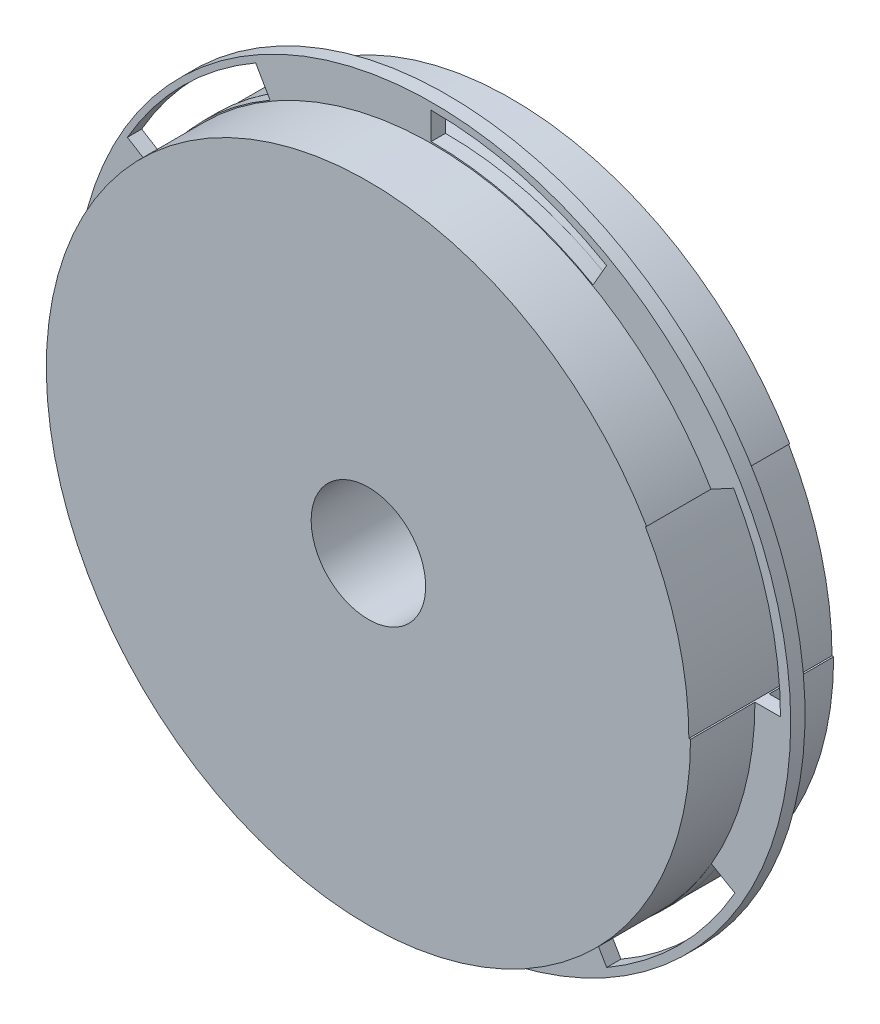
ISO-10303-21;
HEADER;
FILE_DESCRIPTION(('STEP AP214'),'2;1');
FILE_NAME('part.step','',(''),(''),'','','');
FILE_SCHEMA(('AUTOMOTIVE_DESIGN { 1 0 10303 214 1 1 1 1 }'));
ENDSEC;
DATA;
#1=APPLICATION_CONTEXT('core data for automotive mechanical design processes');
#2=APPLICATION_PROTOCOL_DEFINITION('international standard','automotive_design',2000,#1);
#3=PRODUCT_CONTEXT('',#1,'mechanical');
#4=PRODUCT('Part','Part','',(#3));
#5=PRODUCT_RELATED_PRODUCT_CATEGORY('part','',(#4));
#6=PRODUCT_DEFINITION_FORMATION('','',#4);
#7=PRODUCT_DEFINITION_CONTEXT('part definition',#1,'design');
#8=PRODUCT_DEFINITION('design','',#6,#7);
#9=PRODUCT_DEFINITION_SHAPE('','',#8);
#10=(LENGTH_UNIT() NAMED_UNIT(*) SI_UNIT(.MILLI.,.METRE.));
#11=(NAMED_UNIT(*) PLANE_ANGLE_UNIT() SI_UNIT($,.RADIAN.));
#12=(NAMED_UNIT(*) SI_UNIT($,.STERADIAN.) SOLID_ANGLE_UNIT());
#13=UNCERTAINTY_MEASURE_WITH_UNIT(LENGTH_MEASURE(1.E-05),#10,'distance_accuracy_value','');
#14=(GEOMETRIC_REPRESENTATION_CONTEXT(3) GLOBAL_UNCERTAINTY_ASSIGNED_CONTEXT((#13)) GLOBAL_UNIT_ASSIGNED_CONTEXT((#10,
#11,#12)) REPRESENTATION_CONTEXT('',''));
#15=CARTESIAN_POINT('',(0.,0.,0.));
#16=DIRECTION('',(0.,0.,1.));
#17=DIRECTION('',(1.,0.,0.));
#18=AXIS2_PLACEMENT_3D('',#15,#16,#17);
#19=CARTESIAN_POINT('',(-23.5895127727693,15.6012459474451,10.));
#20=DIRECTION('',(0.,0.,-1.));
#21=DIRECTION('',(-1.,0.,0.));
#22=AXIS2_PLACEMENT_3D('',#19,#20,#21);
#23=CYLINDRICAL_SURFACE('',#22,25.);
#24=CARTESIAN_POINT('',(-23.5895127727693,15.6012459474451,5.5));
#25=DIRECTION('',(0.,0.,1.));
#26=DIRECTION('',(1.,0.,0.));
#27=AXIS2_PLACEMENT_3D('',#24,#25,#26);
#28=CIRCLE('',#27,25.);
#29=CARTESIAN_POINT('',(1.41048722723074,15.6012459474451,5.5));
#30=VERTEX_POINT('',#29);
#31=EDGE_CURVE('E305',#30,#30,#28,.T.);
#32=ORIENTED_EDGE('',*,*,#31,.F.);
#33=EDGE_LOOP('',(#32));
#34=FACE_BOUND('',#33,.T.);
#35=CARTESIAN_POINT('',(-23.5895127727693,15.6012459474451,4.5));
#36=DIRECTION('',(0.,0.,-1.));
#37=DIRECTION('',(-1.,0.,0.));
#38=AXIS2_PLACEMENT_3D('',#35,#36,#37);
#39=CIRCLE('',#38,25.);
#40=CARTESIAN_POINT('',(-48.5895127727693,15.6012459474451,4.5));
#41=VERTEX_POINT('',#40);
#42=EDGE_CURVE('E249',#41,#41,#39,.T.);
#43=ORIENTED_EDGE('',*,*,#42,.F.);
#44=EDGE_LOOP('',(#43));
#45=FACE_BOUND('',#44,.T.);
#46=ADVANCED_FACE('F39',(#34,#45),#23,.T.);
#47=CARTESIAN_POINT('',(-23.647365997325,15.7014506717574,0.));
#48=DIRECTION('',(0.,0.,1.));
#49=DIRECTION('',(1.,0.,0.));
#50=AXIS2_PLACEMENT_3D('',#47,#48,#49);
#51=CYLINDRICAL_SURFACE('',#50,22.5);
#52=DIRECTION('',(0.,0.,1.));
#53=VECTOR('',#52,1.);
#54=CARTESIAN_POINT('',(-12.3973659973248,35.1870222569071,0.));
#55=LINE('',#54,#53);
#56=CARTESIAN_POINT('',(-12.3973659973248,35.1870222569071,4.5));
#57=VERTEX_POINT('',#56);
#58=CARTESIAN_POINT('',(-12.3973659973248,35.1870222569071,5.5));
#59=VERTEX_POINT('',#58);
#60=EDGE_CURVE('E395',#57,#59,#55,.T.);
#61=ORIENTED_EDGE('',*,*,#60,.F.);
#62=CARTESIAN_POINT('',(-23.647365997325,15.7014506717574,4.5));
#63=DIRECTION('',(0.,0.,-1.));
#64=DIRECTION('',(-1.,0.,0.));
#65=AXIS2_PLACEMENT_3D('',#62,#63,#64);
#66=CIRCLE('',#65,22.5);
#67=CARTESIAN_POINT('',(-23.7052192218805,38.2013762939547,4.5));
#68=VERTEX_POINT('',#67);
#69=EDGE_CURVE('E53',#57,#68,#66,.F.);
#70=ORIENTED_EDGE('',*,*,#69,.T.);
#71=DIRECTION('',(0.,0.,1.));
#72=VECTOR('',#71,1.);
#73=CARTESIAN_POINT('',(-23.7052192218805,38.2013762939547,0.));
#74=LINE('',#73,#72);
#75=CARTESIAN_POINT('',(-23.7052192218805,38.2013762939547,5.5));
#76=VERTEX_POINT('',#75);
#77=EDGE_CURVE('E440',#68,#76,#74,.T.);
#78=ORIENTED_EDGE('',*,*,#77,.T.);
#79=CARTESIAN_POINT('',(-23.647365997325,15.7014506717574,5.5));
#80=DIRECTION('',(0.,0.,1.));
#81=DIRECTION('',(1.,0.,0.));
#82=AXIS2_PLACEMENT_3D('',#79,#80,#81);
#83=CIRCLE('',#82,22.5);
#84=EDGE_CURVE('E372',#76,#59,#83,.F.);
#85=ORIENTED_EDGE('',*,*,#84,.T.);
#86=EDGE_LOOP('',(#61,#70,#78,#85));
#87=FACE_BOUND('',#86,.T.);
#88=ADVANCED_FACE('F497',(#87),#51,.T.);
#89=CARTESIAN_POINT('',(-23.7052192218809,2.59717104861497E-13,0.));
#90=DIRECTION('',(1.,0.,0.));
#91=DIRECTION('',(0.,1.,0.));
#92=AXIS2_PLACEMENT_3D('',#89,#90,#91);
#93=PLANE('',#92);
#94=ORIENTED_EDGE('',*,*,#77,.F.);
#95=DIRECTION('',(0.,1.,0.));
#96=VECTOR('',#95,1.);
#97=CARTESIAN_POINT('',(-23.7052192218809,2.59717104861497E-13,4.5));
#98=LINE('',#97,#96);
#99=CARTESIAN_POINT('',(-23.7052192218805,40.1013820856858,4.5));
#100=VERTEX_POINT('',#99);
#101=EDGE_CURVE('E297',#68,#100,#98,.T.);
#102=ORIENTED_EDGE('',*,*,#101,.T.);
#103=DIRECTION('',(0.,0.,1.));
#104=VECTOR('',#103,1.);
#105=CARTESIAN_POINT('',(-23.7052192218805,40.1013820856858,0.));
#106=LINE('',#105,#104);
#107=CARTESIAN_POINT('',(-23.7052192218805,40.1013820856858,5.5));
#108=VERTEX_POINT('',#107);
#109=EDGE_CURVE('E443',#100,#108,#106,.T.);
#110=ORIENTED_EDGE('',*,*,#109,.T.);
#111=DIRECTION('',(0.,-1.,0.));
#112=VECTOR('',#111,1.);
#113=CARTESIAN_POINT('',(-23.7052192218809,2.59717104861497E-13,5.5));
#114=LINE('',#113,#112);
#115=EDGE_CURVE('E369',#108,#76,#114,.T.);
#116=ORIENTED_EDGE('',*,*,#115,.T.);
#117=EDGE_LOOP('',(#94,#102,#110,#116));
#118=FACE_BOUND('',#117,.T.);
#119=ADVANCED_FACE('F502',(#118),#93,.T.);
#120=CARTESIAN_POINT('',(-23.647365997325,15.7014506717574,0.));
#121=DIRECTION('',(0.,0.,1.));
#122=DIRECTION('',(1.,0.,0.));
#123=AXIS2_PLACEMENT_3D('',#120,#121,#122);
#124=CYLINDRICAL_SURFACE('',#123,24.4);
#125=CARTESIAN_POINT('',(-23.647365997325,15.7014506717574,4.5));
#126=DIRECTION('',(0.,0.,-1.));
#127=DIRECTION('',(-1.,0.,0.));
#128=AXIS2_PLACEMENT_3D('',#125,#126,#127);
#129=CIRCLE('',#128,24.4);
#130=CARTESIAN_POINT('',(-11.4473659973248,36.8324705240976,4.5));
#131=VERTEX_POINT('',#130);
#132=EDGE_CURVE('E295',#131,#100,#129,.F.);
#133=ORIENTED_EDGE('',*,*,#132,.F.);
#134=DIRECTION('',(0.,0.,1.));
#135=VECTOR('',#134,1.);
#136=CARTESIAN_POINT('',(-11.4473659973248,36.8324705240976,0.));
#137=LINE('',#136,#135);
#138=CARTESIAN_POINT('',(-11.4473659973248,36.8324705240976,5.5));
#139=VERTEX_POINT('',#138);
#140=EDGE_CURVE('E445',#131,#139,#137,.T.);
#141=ORIENTED_EDGE('',*,*,#140,.T.);
#142=CARTESIAN_POINT('',(-23.647365997325,15.7014506717574,5.5));
#143=DIRECTION('',(0.,0.,1.));
#144=DIRECTION('',(1.,0.,0.));
#145=AXIS2_PLACEMENT_3D('',#142,#143,#144);
#146=CIRCLE('',#145,24.4);
#147=EDGE_CURVE('E366',#108,#139,#146,.F.);
#148=ORIENTED_EDGE('',*,*,#147,.F.);
#149=ORIENTED_EDGE('',*,*,#109,.F.);
#150=EDGE_LOOP('',(#133,#141,#148,#149));
#151=FACE_BOUND('',#150,.T.);
#152=ADVANCED_FACE('F562',(#151),#124,.F.);
#153=CARTESIAN_POINT('',(-24.5344520769987,14.1649725110756,0.));
#154=DIRECTION('',(0.866025403784433,-0.50000000000001,0.));
#155=DIRECTION('',(0.50000000000001,0.866025403784433,0.));
#156=AXIS2_PLACEMENT_3D('',#153,#154,#155);
#157=PLANE('',#156);
#158=DIRECTION('',(0.50000000000001,0.866025403784433,0.));
#159=VECTOR('',#158,1.);
#160=CARTESIAN_POINT('',(-24.5344520769987,14.1649725110756,4.5));
#161=LINE('',#160,#159);
#162=EDGE_CURVE('E293',#57,#131,#161,.T.);
#163=ORIENTED_EDGE('',*,*,#162,.F.);
#164=ORIENTED_EDGE('',*,*,#60,.T.);
#165=DIRECTION('',(-0.50000000000001,-0.866025403784433,0.));
#166=VECTOR('',#165,1.);
#167=CARTESIAN_POINT('',(-24.5344520769987,14.1649725110756,5.5));
#168=LINE('',#167,#166);
#169=EDGE_CURVE('E363',#139,#59,#168,.T.);
#170=ORIENTED_EDGE('',*,*,#169,.F.);
#171=ORIENTED_EDGE('',*,*,#140,.F.);
#172=EDGE_LOOP('',(#163,#164,#170,#171));
#173=FACE_BOUND('',#172,.T.);
#174=ADVANCED_FACE('F566',(#173),#157,.F.);
#175=CARTESIAN_POINT('',(-35.0130724464367,-3.98453036201698,0.));
#176=DIRECTION('',(-0.866025403784437,0.500000000000003,0.));
#177=DIRECTION('',(-0.500000000000003,-0.866025403784437,0.));
#178=AXIS2_PLACEMENT_3D('',#175,#176,#177);
#179=PLANE('',#178);
#180=DIRECTION('',(-0.500000000000003,-0.866025403784437,0.));
#181=VECTOR('',#180,1.);
#182=CARTESIAN_POINT('',(-35.0130724464367,-3.98453036201698,4.5));
#183=LINE('',#182,#181);
#184=CARTESIAN_POINT('',(-35.0130724464367,-3.98453036201698,4.5));
#185=VERTEX_POINT('',#184);
#186=CARTESIAN_POINT('',(-35.9630724464367,-5.6299786292074,4.5));
#187=VERTEX_POINT('',#186);
#188=EDGE_CURVE('E61',#185,#187,#183,.T.);
#189=ORIENTED_EDGE('',*,*,#188,.F.);
#190=DIRECTION('',(0.,0.,1.));
#191=VECTOR('',#190,1.);
#192=CARTESIAN_POINT('',(-35.0130724464367,-3.98453036201698,0.));
#193=LINE('',#192,#191);
#194=CARTESIAN_POINT('',(-35.0130724464367,-3.98453036201698,5.5));
#195=VERTEX_POINT('',#194);
#196=EDGE_CURVE('E382',#185,#195,#193,.T.);
#197=ORIENTED_EDGE('',*,*,#196,.T.);
#198=DIRECTION('',(0.500000000000003,0.866025403784437,0.));
#199=VECTOR('',#198,1.);
#200=CARTESIAN_POINT('',(-35.0130724464367,-3.98453036201698,5.5));
#201=LINE('',#200,#199);
#202=CARTESIAN_POINT('',(-35.9630724464367,-5.62997862920741,5.5));
#203=VERTEX_POINT('',#202);
#204=EDGE_CURVE('E360',#203,#195,#201,.T.);
#205=ORIENTED_EDGE('',*,*,#204,.F.);
#206=DIRECTION('',(0.,0.,1.));
#207=VECTOR('',#206,1.);
#208=CARTESIAN_POINT('',(-35.9630724464367,-5.6299786292074,0.));
#209=LINE('',#208,#207);
#210=EDGE_CURVE('E385',#187,#203,#209,.T.);
#211=ORIENTED_EDGE('',*,*,#210,.F.);
#212=EDGE_LOOP('',(#189,#197,#205,#211));
#213=FACE_BOUND('',#212,.T.);
#214=ADVANCED_FACE('F569',(#213),#179,.F.);
#215=CARTESIAN_POINT('',(-23.7630724464366,15.5010412231328,0.));
#216=DIRECTION('',(0.,0.,1.));
#217=DIRECTION('',(1.,0.,0.));
#218=AXIS2_PLACEMENT_3D('',#215,#216,#217);
#219=CYLINDRICAL_SURFACE('',#218,22.5);
#220=ORIENTED_EDGE('',*,*,#196,.F.);
#221=CARTESIAN_POINT('',(-23.7630724464366,15.5010412231328,4.5));
#222=DIRECTION('',(0.,0.,-1.));
#223=DIRECTION('',(-1.,0.,0.));
#224=AXIS2_PLACEMENT_3D('',#221,#222,#223);
#225=CIRCLE('',#224,22.5);
#226=CARTESIAN_POINT('',(-23.7052192218809,-6.99888439906442,4.5));
#227=VERTEX_POINT('',#226);
#228=EDGE_CURVE('E289',#185,#227,#225,.F.);
#229=ORIENTED_EDGE('',*,*,#228,.T.);
#230=DIRECTION('',(0.,0.,1.));
#231=VECTOR('',#230,1.);
#232=CARTESIAN_POINT('',(-23.7052192218809,-6.99888439906442,0.));
#233=LINE('',#232,#231);
#234=CARTESIAN_POINT('',(-23.7052192218809,-6.99888439906442,5.5));
#235=VERTEX_POINT('',#234);
#236=EDGE_CURVE('E390',#227,#235,#233,.T.);
#237=ORIENTED_EDGE('',*,*,#236,.T.);
#238=CARTESIAN_POINT('',(-23.7630724464366,15.5010412231328,5.5));
#239=DIRECTION('',(0.,0.,1.));
#240=DIRECTION('',(1.,0.,0.));
#241=AXIS2_PLACEMENT_3D('',#238,#239,#240);
#242=CIRCLE('',#241,22.5);
#243=EDGE_CURVE('E357',#235,#195,#242,.F.);
#244=ORIENTED_EDGE('',*,*,#243,.T.);
#245=EDGE_LOOP('',(#220,#229,#237,#244));
#246=FACE_BOUND('',#245,.T.);
#247=ADVANCED_FACE('F599',(#246),#219,.T.);
#248=CARTESIAN_POINT('',(-23.7052192218809,-6.99888439906442,0.));
#249=DIRECTION('',(-1.,0.,0.));
#250=DIRECTION('',(0.,-1.,0.));
#251=AXIS2_PLACEMENT_3D('',#248,#249,#250);
#252=PLANE('',#251);
#253=ORIENTED_EDGE('',*,*,#236,.F.);
#254=DIRECTION('',(0.,-1.,0.));
#255=VECTOR('',#254,1.);
#256=CARTESIAN_POINT('',(-23.7052192218809,-6.99888439906442,4.5));
#257=LINE('',#256,#255);
#258=CARTESIAN_POINT('',(-23.7052192218809,-8.89889019079553,4.5));
#259=VERTEX_POINT('',#258);
#260=EDGE_CURVE('E286',#227,#259,#257,.T.);
#261=ORIENTED_EDGE('',*,*,#260,.T.);
#262=DIRECTION('',(0.,0.,1.));
#263=VECTOR('',#262,1.);
#264=CARTESIAN_POINT('',(-23.7052192218809,-8.89889019079554,0.));
#265=LINE('',#264,#263);
#266=CARTESIAN_POINT('',(-23.7052192218809,-8.89889019079554,5.5));
#267=VERTEX_POINT('',#266);
#268=EDGE_CURVE('E388',#259,#267,#265,.T.);
#269=ORIENTED_EDGE('',*,*,#268,.T.);
#270=DIRECTION('',(0.,1.,0.));
#271=VECTOR('',#270,1.);
#272=CARTESIAN_POINT('',(-23.7052192218809,-6.99888439906442,5.5));
#273=LINE('',#272,#271);
#274=EDGE_CURVE('E354',#267,#235,#273,.T.);
#275=ORIENTED_EDGE('',*,*,#274,.T.);
#276=EDGE_LOOP('',(#253,#261,#269,#275));
#277=FACE_BOUND('',#276,.T.);
#278=ADVANCED_FACE('F604',(#277),#252,.T.);
#279=CARTESIAN_POINT('',(-23.7630724464366,15.5010412231328,0.));
#280=DIRECTION('',(0.,0.,1.));
#281=DIRECTION('',(1.,0.,0.));
#282=AXIS2_PLACEMENT_3D('',#279,#280,#281);
#283=CYLINDRICAL_SURFACE('',#282,24.4);
#284=CARTESIAN_POINT('',(-23.7630724464366,15.5010412231328,4.5));
#285=DIRECTION('',(0.,0.,-1.));
#286=DIRECTION('',(-1.,0.,0.));
#287=AXIS2_PLACEMENT_3D('',#284,#285,#286);
#288=CIRCLE('',#287,24.4);
#289=EDGE_CURVE('E284',#187,#259,#288,.F.);
#290=ORIENTED_EDGE('',*,*,#289,.F.);
#291=ORIENTED_EDGE('',*,*,#210,.T.);
#292=CARTESIAN_POINT('',(-23.7630724464366,15.5010412231328,5.5));
#293=DIRECTION('',(0.,0.,1.));
#294=DIRECTION('',(1.,0.,0.));
#295=AXIS2_PLACEMENT_3D('',#292,#293,#294);
#296=CIRCLE('',#295,24.4);
#297=EDGE_CURVE('E351',#267,#203,#296,.F.);
#298=ORIENTED_EDGE('',*,*,#297,.F.);
#299=ORIENTED_EDGE('',*,*,#268,.F.);
#300=EDGE_LOOP('',(#290,#291,#298,#299));
#301=FACE_BOUND('',#300,.T.);
#302=ADVANCED_FACE('F601',(#301),#283,.F.);
#303=CARTESIAN_POINT('',(-12.3973659973251,-3.98453036201706,0.));
#304=DIRECTION('',(-0.86602540378444,-0.499999999999998,0.));
#305=DIRECTION('',(0.499999999999998,-0.86602540378444,0.));
#306=AXIS2_PLACEMENT_3D('',#303,#304,#305);
#307=PLANE('',#306);
#308=DIRECTION('',(0.499999999999998,-0.86602540378444,0.));
#309=VECTOR('',#308,1.);
#310=CARTESIAN_POINT('',(-12.3973659973251,-3.98453036201706,4.5));
#311=LINE('',#310,#309);
#312=CARTESIAN_POINT('',(-12.3973659973251,-3.98453036201706,4.5));
#313=VERTEX_POINT('',#312);
#314=CARTESIAN_POINT('',(-11.4473659973251,-5.6299786292075,4.5));
#315=VERTEX_POINT('',#314);
#316=EDGE_CURVE('E282',#313,#315,#311,.T.);
#317=ORIENTED_EDGE('',*,*,#316,.F.);
#318=DIRECTION('',(0.,0.,1.));
#319=VECTOR('',#318,1.);
#320=CARTESIAN_POINT('',(-12.3973659973251,-3.98453036201706,0.));
#321=LINE('',#320,#319);
#322=CARTESIAN_POINT('',(-12.3973659973251,-3.98453036201706,5.5));
#323=VERTEX_POINT('',#322);
#324=EDGE_CURVE('E387',#313,#323,#321,.T.);
#325=ORIENTED_EDGE('',*,*,#324,.T.);
#326=DIRECTION('',(-0.499999999999998,0.86602540378444,0.));
#327=VECTOR('',#326,1.);
#328=CARTESIAN_POINT('',(-12.3973659973251,-3.98453036201706,5.5));
#329=LINE('',#328,#327);
#330=CARTESIAN_POINT('',(-11.4473659973251,-5.6299786292075,5.5));
#331=VERTEX_POINT('',#330);
#332=EDGE_CURVE('E348',#331,#323,#329,.T.);
#333=ORIENTED_EDGE('',*,*,#332,.F.);
#334=DIRECTION('',(0.,0.,1.));
#335=VECTOR('',#334,1.);
#336=CARTESIAN_POINT('',(-11.4473659973251,-5.6299786292075,0.));
#337=LINE('',#336,#335);
#338=EDGE_CURVE('E420',#315,#331,#337,.T.);
#339=ORIENTED_EDGE('',*,*,#338,.F.);
#340=EDGE_LOOP('',(#317,#325,#333,#339));
#341=FACE_BOUND('',#340,.T.);
#342=ADVANCED_FACE('F554',(#341),#307,.F.);
#343=CARTESIAN_POINT('',(-23.647365997325,15.5010412231328,0.));
#344=DIRECTION('',(0.,0.,1.));
#345=DIRECTION('',(1.,0.,0.));
#346=AXIS2_PLACEMENT_3D('',#343,#344,#345);
#347=CYLINDRICAL_SURFACE('',#346,22.5);
#348=ORIENTED_EDGE('',*,*,#324,.F.);
#349=CARTESIAN_POINT('',(-23.647365997325,15.5010412231328,4.5));
#350=DIRECTION('',(0.,0.,-1.));
#351=DIRECTION('',(-1.,0.,0.));
#352=AXIS2_PLACEMENT_3D('',#349,#350,#351);
#353=CIRCLE('',#352,22.5);
#354=CARTESIAN_POINT('',(-4.13293221296396,4.30118077419031,4.5));
#355=VERTEX_POINT('',#354);
#356=EDGE_CURVE('E280',#313,#355,#353,.F.);
#357=ORIENTED_EDGE('',*,*,#356,.T.);
#358=DIRECTION('',(0.,0.,1.));
#359=VECTOR('',#358,1.);
#360=CARTESIAN_POINT('',(-4.13293221296395,4.3011807741903,0.));
#361=LINE('',#360,#359);
#362=CARTESIAN_POINT('',(-4.13293221296395,4.30118077419031,5.5));
#363=VERTEX_POINT('',#362);
#364=EDGE_CURVE('E437',#355,#363,#361,.T.);
#365=ORIENTED_EDGE('',*,*,#364,.T.);
#366=CARTESIAN_POINT('',(-23.647365997325,15.5010412231328,5.5));
#367=DIRECTION('',(0.,0.,1.));
#368=DIRECTION('',(1.,0.,0.));
#369=AXIS2_PLACEMENT_3D('',#366,#367,#368);
#370=CIRCLE('',#369,22.5);
#371=EDGE_CURVE('E345',#363,#323,#370,.F.);
#372=ORIENTED_EDGE('',*,*,#371,.T.);
#373=EDGE_LOOP('',(#348,#357,#365,#372));
#374=FACE_BOUND('',#373,.T.);
#375=ADVANCED_FACE('F549',(#374),#347,.T.);
#376=CARTESIAN_POINT('',(-4.13293221296395,4.30118077419031,0.));
#377=DIRECTION('',(-0.500000000000002,-0.866025403784437,0.));
#378=DIRECTION('',(0.866025403784437,-0.500000000000002,0.));
#379=AXIS2_PLACEMENT_3D('',#376,#377,#378);
#380=PLANE('',#379);
#381=ORIENTED_EDGE('',*,*,#364,.F.);
#382=DIRECTION('',(0.866025403784437,-0.500000000000002,0.));
#383=VECTOR('',#382,1.);
#384=CARTESIAN_POINT('',(-4.13293221296395,4.30118077419031,4.5));
#385=LINE('',#384,#383);
#386=CARTESIAN_POINT('',(-2.48747892998724,3.35117787832474,4.5));
#387=VERTEX_POINT('',#386);
#388=EDGE_CURVE('E277',#355,#387,#385,.T.);
#389=ORIENTED_EDGE('',*,*,#388,.T.);
#390=DIRECTION('',(0.,0.,1.));
#391=VECTOR('',#390,1.);
#392=CARTESIAN_POINT('',(-2.48747892998724,3.35117787832474,0.));
#393=LINE('',#392,#391);
#394=CARTESIAN_POINT('',(-2.48747892998724,3.35117787832474,5.5));
#395=VERTEX_POINT('',#394);
#396=EDGE_CURVE('E435',#387,#395,#393,.T.);
#397=ORIENTED_EDGE('',*,*,#396,.T.);
#398=DIRECTION('',(-0.866025403784437,0.500000000000002,0.));
#399=VECTOR('',#398,1.);
#400=CARTESIAN_POINT('',(-4.13293221296395,4.30118077419031,5.5));
#401=LINE('',#400,#399);
#402=EDGE_CURVE('E342',#395,#363,#401,.T.);
#403=ORIENTED_EDGE('',*,*,#402,.T.);
#404=EDGE_LOOP('',(#381,#389,#397,#403));
#405=FACE_BOUND('',#404,.T.);
#406=ADVANCED_FACE('F543',(#405),#380,.T.);
#407=CARTESIAN_POINT('',(-23.647365997325,15.5010412231328,0.));
#408=DIRECTION('',(0.,0.,1.));
#409=DIRECTION('',(1.,0.,0.));
#410=AXIS2_PLACEMENT_3D('',#407,#408,#409);
#411=CYLINDRICAL_SURFACE('',#410,24.4);
#412=CARTESIAN_POINT('',(-23.647365997325,15.5010412231328,4.5));
#413=DIRECTION('',(0.,0.,-1.));
#414=DIRECTION('',(-1.,0.,0.));
#415=AXIS2_PLACEMENT_3D('',#412,#413,#414);
#416=CIRCLE('',#415,24.4);
#417=EDGE_CURVE('E275',#315,#387,#416,.F.);
#418=ORIENTED_EDGE('',*,*,#417,.F.);
#419=ORIENTED_EDGE('',*,*,#338,.T.);
#420=CARTESIAN_POINT('',(-23.647365997325,15.5010412231328,5.5));
#421=DIRECTION('',(0.,0.,1.));
#422=DIRECTION('',(1.,0.,0.));
#423=AXIS2_PLACEMENT_3D('',#420,#421,#422);
#424=CIRCLE('',#423,24.4);
#425=EDGE_CURVE('E339',#395,#331,#424,.F.);
#426=ORIENTED_EDGE('',*,*,#425,.F.);
#427=ORIENTED_EDGE('',*,*,#396,.F.);
#428=EDGE_LOOP('',(#418,#419,#426,#427));
#429=FACE_BOUND('',#428,.T.);
#430=ADVANCED_FACE('F539',(#429),#411,.F.);
#431=CARTESIAN_POINT('',(-1.20440947359921,15.599005033376,0.));
#432=DIRECTION('',(0.00117436819502523,-0.999999310429434,0.));
#433=DIRECTION('',(0.999999310429434,0.00117436819502523,0.));
#434=AXIS2_PLACEMENT_3D('',#431,#432,#433);
#435=PLANE('',#434);
#436=DIRECTION('',(0.999999310429434,0.00117436819502523,0.));
#437=VECTOR('',#436,1.);
#438=CARTESIAN_POINT('',(-1.20440947359921,15.599005033376,4.5));
#439=LINE('',#438,#437);
#440=CARTESIAN_POINT('',(-1.08951287132848,15.5991399643845,4.5));
#441=VERTEX_POINT('',#440);
#442=CARTESIAN_POINT('',(0.695590424378664,15.6012363343654,4.5));
#443=VERTEX_POINT('',#442);
#444=EDGE_CURVE('E233',#441,#443,#439,.T.);
#445=ORIENTED_EDGE('',*,*,#444,.F.);
#446=DIRECTION('',(0.,0.,-1.));
#447=VECTOR('',#446,1.);
#448=CARTESIAN_POINT('',(-1.08951287132848,15.5991399643845,4.5));
#449=LINE('',#448,#447);
#450=CARTESIAN_POINT('',(-1.08951287132848,15.5991399643845,0.));
#451=VERTEX_POINT('',#450);
#452=EDGE_CURVE('E248',#451,#441,#449,.F.);
#453=ORIENTED_EDGE('',*,*,#452,.F.);
#454=DIRECTION('',(0.999999310429434,0.00117436819502523,0.));
#455=VECTOR('',#454,1.);
#456=CARTESIAN_POINT('',(-1.20440947359921,15.599005033376,0.));
#457=LINE('',#456,#455);
#458=CARTESIAN_POINT('',(-1.20440947359921,15.599005033376,0.));
#459=VERTEX_POINT('',#458);
#460=EDGE_CURVE('E425',#459,#451,#457,.T.);
#461=ORIENTED_EDGE('',*,*,#460,.F.);
#462=DIRECTION('',(0.,0.,1.));
#463=VECTOR('',#462,1.);
#464=CARTESIAN_POINT('',(-1.20440947359921,15.599005033376,0.));
#465=LINE('',#464,#463);
#466=CARTESIAN_POINT('',(-1.20440947359921,15.599005033376,10.));
#467=VERTEX_POINT('',#466);
#468=EDGE_CURVE('E418',#459,#467,#465,.T.);
#469=ORIENTED_EDGE('',*,*,#468,.T.);
#470=DIRECTION('',(0.999999310429434,0.00117436819502523,0.));
#471=VECTOR('',#470,1.);
#472=CARTESIAN_POINT('',(-1.20440947359921,15.599005033376,10.));
#473=LINE('',#472,#471);
#474=CARTESIAN_POINT('',(-1.08951287132847,15.5991399643845,10.));
#475=VERTEX_POINT('',#474);
#476=EDGE_CURVE('E410',#467,#475,#473,.T.);
#477=ORIENTED_EDGE('',*,*,#476,.T.);
#478=DIRECTION('',(0.,0.,1.));
#479=VECTOR('',#478,1.);
#480=CARTESIAN_POINT('',(-1.08951287132847,15.5991399643845,5.5));
#481=LINE('',#480,#479);
#482=CARTESIAN_POINT('',(-1.08951287132847,15.5991399643845,5.5));
#483=VERTEX_POINT('',#482);
#484=EDGE_CURVE('E375',#483,#475,#481,.T.);
#485=ORIENTED_EDGE('',*,*,#484,.F.);
#486=DIRECTION('',(-0.999999310429434,-0.00117436819502523,0.));
#487=VECTOR('',#486,1.);
#488=CARTESIAN_POINT('',(-1.20440947359921,15.599005033376,5.5));
#489=LINE('',#488,#487);
#490=CARTESIAN_POINT('',(0.695590424378664,15.6012363343654,5.5));
#491=VERTEX_POINT('',#490);
#492=EDGE_CURVE('E337',#491,#483,#489,.T.);
#493=ORIENTED_EDGE('',*,*,#492,.F.);
#494=DIRECTION('',(0.,0.,1.));
#495=VECTOR('',#494,1.);
#496=CARTESIAN_POINT('',(0.695590424378664,15.6012363343654,0.));
#497=LINE('',#496,#495);
#498=EDGE_CURVE('E411',#443,#491,#497,.T.);
#499=ORIENTED_EDGE('',*,*,#498,.F.);
#500=EDGE_LOOP('',(#445,#453,#461,#469,#477,#485,#493,#499));
#501=FACE_BOUND('',#500,.T.);
#502=ADVANCED_FACE('F457',(#501),#435,.F.);
#503=CARTESIAN_POINT('',(-4.24782891379388,26.8990702066308,0.));
#504=DIRECTION('',(0.474415238988805,-0.880301187671126,0.));
#505=DIRECTION('',(0.880301187671126,0.474415238988805,0.));
#506=AXIS2_PLACEMENT_3D('',#503,#504,#505);
#507=PLANE('',#506);
#508=DIRECTION('',(0.,0.,-1.));
#509=VECTOR('',#508,1.);
#510=CARTESIAN_POINT('',(-4.15938462973405,26.9467349340526,4.5));
#511=LINE('',#510,#509);
#512=CARTESIAN_POINT('',(-4.15938462973405,26.9467349340526,0.));
#513=VERTEX_POINT('',#512);
#514=CARTESIAN_POINT('',(-4.15938462973405,26.9467349340526,4.5));
#515=VERTEX_POINT('',#514);
#516=EDGE_CURVE('E238',#513,#515,#511,.F.);
#517=ORIENTED_EDGE('',*,*,#516,.T.);
#518=DIRECTION('',(0.880301187671126,0.474415238988805,0.));
#519=VECTOR('',#518,1.);
#520=CARTESIAN_POINT('',(-4.24782891379388,26.8990702066308,4.5));
#521=LINE('',#520,#519);
#522=CARTESIAN_POINT('',(-2.57447308112206,27.8008814484973,4.5));
#523=VERTEX_POINT('',#522);
#524=EDGE_CURVE('E222',#515,#523,#521,.T.);
#525=ORIENTED_EDGE('',*,*,#524,.T.);
#526=DIRECTION('',(0.,0.,1.));
#527=VECTOR('',#526,1.);
#528=CARTESIAN_POINT('',(-2.57447308112206,27.8008814484973,0.));
#529=LINE('',#528,#527);
#530=CARTESIAN_POINT('',(-2.57447308112206,27.8008814484973,5.5));
#531=VERTEX_POINT('',#530);
#532=EDGE_CURVE('E414',#523,#531,#529,.T.);
#533=ORIENTED_EDGE('',*,*,#532,.T.);
#534=DIRECTION('',(-0.880301187671126,-0.474415238988805,0.));
#535=VECTOR('',#534,1.);
#536=CARTESIAN_POINT('',(-4.24782891379388,26.8990702066308,5.5));
#537=LINE('',#536,#535);
#538=CARTESIAN_POINT('',(-4.15938462973404,26.9467349340526,5.5));
#539=VERTEX_POINT('',#538);
#540=EDGE_CURVE('E334',#531,#539,#537,.T.);
#541=ORIENTED_EDGE('',*,*,#540,.T.);
#542=DIRECTION('',(0.,0.,1.));
#543=VECTOR('',#542,1.);
#544=CARTESIAN_POINT('',(-4.15938462973404,26.9467349340526,5.5));
#545=LINE('',#544,#543);
#546=CARTESIAN_POINT('',(-4.15938462973404,26.9467349340526,10.));
#547=VERTEX_POINT('',#546);
#548=EDGE_CURVE('E450',#539,#547,#545,.T.);
#549=ORIENTED_EDGE('',*,*,#548,.T.);
#550=DIRECTION('',(0.880301187671126,0.474415238988805,0.));
#551=VECTOR('',#550,1.);
#552=CARTESIAN_POINT('',(-4.24782891379388,26.8990702066308,10.));
#553=LINE('',#552,#551);
#554=CARTESIAN_POINT('',(-4.24782891379388,26.8990702066308,10.));
#555=VERTEX_POINT('',#554);
#556=EDGE_CURVE('E424',#555,#547,#553,.T.);
#557=ORIENTED_EDGE('',*,*,#556,.F.);
#558=DIRECTION('',(0.,0.,1.));
#559=VECTOR('',#558,1.);
#560=CARTESIAN_POINT('',(-4.24782891379388,26.8990702066308,0.));
#561=LINE('',#560,#559);
#562=CARTESIAN_POINT('',(-4.24782891379388,26.8990702066308,0.));
#563=VERTEX_POINT('',#562);
#564=EDGE_CURVE('E416',#563,#555,#561,.T.);
#565=ORIENTED_EDGE('',*,*,#564,.F.);
#566=DIRECTION('',(0.880301187671126,0.474415238988805,0.));
#567=VECTOR('',#566,1.);
#568=CARTESIAN_POINT('',(-4.24782891379388,26.8990702066308,0.));
#569=LINE('',#568,#567);
#570=EDGE_CURVE('E247',#563,#513,#569,.T.);
#571=ORIENTED_EDGE('',*,*,#570,.T.);
#572=EDGE_LOOP('',(#517,#525,#533,#541,#549,#557,#565,#571));
#573=FACE_BOUND('',#572,.T.);
#574=ADVANCED_FACE('F244',(#573),#507,.T.);
#575=CARTESIAN_POINT('',(-23.7044094735992,15.599005033376,0.));
#576=DIRECTION('',(0.,0.,1.));
#577=DIRECTION('',(1.,0.,0.));
#578=AXIS2_PLACEMENT_3D('',#575,#576,#577);
#579=CYLINDRICAL_SURFACE('',#578,24.4000000000005);
#580=CARTESIAN_POINT('',(-23.7044094735992,15.599005033376,4.5));
#581=DIRECTION('',(0.,0.,-1.));
#582=DIRECTION('',(-1.,0.,0.));
#583=AXIS2_PLACEMENT_3D('',#580,#581,#582);
#584=CIRCLE('',#583,24.4000000000005);
#585=EDGE_CURVE('E229',#443,#523,#584,.F.);
#586=ORIENTED_EDGE('',*,*,#585,.F.);
#587=ORIENTED_EDGE('',*,*,#498,.T.);
#588=CARTESIAN_POINT('',(-23.7044094735992,15.599005033376,5.5));
#589=DIRECTION('',(0.,0.,1.));
#590=DIRECTION('',(1.,0.,0.));
#591=AXIS2_PLACEMENT_3D('',#588,#589,#590);
#592=CIRCLE('',#591,24.4000000000005);
#593=EDGE_CURVE('E331',#531,#491,#592,.F.);
#594=ORIENTED_EDGE('',*,*,#593,.F.);
#595=ORIENTED_EDGE('',*,*,#532,.F.);
#596=EDGE_LOOP('',(#586,#587,#594,#595));
#597=FACE_BOUND('',#596,.T.);
#598=ADVANCED_FACE('F483',(#597),#579,.F.);
#599=CARTESIAN_POINT('',(-23.7062021231585,15.5972123838167,0.));
#600=DIRECTION('',(0.,0.,1.));
#601=DIRECTION('',(1.,0.,0.));
#602=AXIS2_PLACEMENT_3D('',#599,#600,#601);
#603=CYLINDRICAL_SURFACE('',#602,22.5);
#604=DIRECTION('',(0.,0.,1.));
#605=VECTOR('',#604,1.);
#606=CARTESIAN_POINT('',(-34.9562021231583,35.0827839689667,0.));
#607=LINE('',#606,#605);
#608=CARTESIAN_POINT('',(-34.9562021231583,35.0827839689667,4.5));
#609=VERTEX_POINT('',#608);
#610=CARTESIAN_POINT('',(-34.9562021231583,35.0827839689667,5.5));
#611=VERTEX_POINT('',#610);
#612=EDGE_CURVE('E402',#609,#611,#607,.T.);
#613=ORIENTED_EDGE('',*,*,#612,.F.);
#614=CARTESIAN_POINT('',(-23.7062021231585,15.5972123838167,4.5));
#615=DIRECTION('',(0.,0.,-1.));
#616=DIRECTION('',(-1.,0.,0.));
#617=AXIS2_PLACEMENT_3D('',#614,#615,#616);
#618=CIRCLE('',#617,22.5);
#619=CARTESIAN_POINT('',(-43.2206359075195,26.7970728327594,4.5));
#620=VERTEX_POINT('',#619);
#621=EDGE_CURVE('E270',#609,#620,#618,.F.);
#622=ORIENTED_EDGE('',*,*,#621,.T.);
#623=DIRECTION('',(0.,0.,1.));
#624=VECTOR('',#623,1.);
#625=CARTESIAN_POINT('',(-43.2206359075195,26.7970728327594,0.));
#626=LINE('',#625,#624);
#627=CARTESIAN_POINT('',(-43.2206359075195,26.7970728327594,5.5));
#628=VERTEX_POINT('',#627);
#629=EDGE_CURVE('E408',#620,#628,#626,.T.);
#630=ORIENTED_EDGE('',*,*,#629,.T.);
#631=CARTESIAN_POINT('',(-23.7062021231585,15.5972123838167,5.5));
#632=DIRECTION('',(0.,0.,1.));
#633=DIRECTION('',(1.,0.,0.));
#634=AXIS2_PLACEMENT_3D('',#631,#632,#633);
#635=CIRCLE('',#634,22.5);
#636=EDGE_CURVE('E328',#628,#611,#635,.F.);
#637=ORIENTED_EDGE('',*,*,#636,.T.);
#638=EDGE_LOOP('',(#613,#622,#630,#637));
#639=FACE_BOUND('',#638,.T.);
#640=ADVANCED_FACE('F485',(#639),#603,.T.);
#641=CARTESIAN_POINT('',(0.0137561486755572,0.0222125799876314,0.));
#642=DIRECTION('',(0.526506902061201,0.850170854641535,0.));
#643=DIRECTION('',(-0.850170854641535,0.526506902061201,0.));
#644=AXIS2_PLACEMENT_3D('',#641,#642,#643);
#645=PLANE('',#644);
#646=ORIENTED_EDGE('',*,*,#629,.F.);
#647=DIRECTION('',(-0.850170854641535,0.526506902061201,0.));
#648=VECTOR('',#647,1.);
#649=CARTESIAN_POINT('',(0.0137561486755572,0.0222125799876314,4.5));
#650=LINE('',#649,#648);
#651=CARTESIAN_POINT('',(-44.9229595137743,27.8513140165656,4.5));
#652=VERTEX_POINT('',#651);
#653=EDGE_CURVE('E267',#620,#652,#650,.T.);
#654=ORIENTED_EDGE('',*,*,#653,.T.);
#655=DIRECTION('',(0.,0.,1.));
#656=VECTOR('',#655,1.);
#657=CARTESIAN_POINT('',(-44.9229595137743,27.8513140165656,0.));
#658=LINE('',#657,#656);
#659=CARTESIAN_POINT('',(-44.9229595137743,27.8513140165656,5.5));
#660=VERTEX_POINT('',#659);
#661=EDGE_CURVE('E406',#652,#660,#658,.T.);
#662=ORIENTED_EDGE('',*,*,#661,.T.);
#663=DIRECTION('',(0.850170854641535,-0.526506902061201,0.));
#664=VECTOR('',#663,1.);
#665=CARTESIAN_POINT('',(0.0137561486755572,0.0222125799876314,5.5));
#666=LINE('',#665,#664);
#667=EDGE_CURVE('E325',#660,#628,#666,.T.);
#668=ORIENTED_EDGE('',*,*,#667,.T.);
#669=EDGE_LOOP('',(#646,#654,#662,#668));
#670=FACE_BOUND('',#669,.T.);
#671=ADVANCED_FACE('F491',(#670),#645,.T.);
#672=CARTESIAN_POINT('',(-23.7630724464366,15.7014506717574,0.));
#673=DIRECTION('',(0.,0.,1.));
#674=DIRECTION('',(1.,0.,0.));
#675=AXIS2_PLACEMENT_3D('',#672,#673,#674);
#676=CYLINDRICAL_SURFACE('',#675,24.4);
#677=CARTESIAN_POINT('',(-23.7630724464366,15.7014506717574,4.5));
#678=DIRECTION('',(0.,0.,-1.));
#679=DIRECTION('',(-1.,0.,0.));
#680=AXIS2_PLACEMENT_3D('',#677,#678,#679);
#681=CIRCLE('',#680,24.4);
#682=CARTESIAN_POINT('',(-35.9630724464364,36.8324705240978,4.5));
#683=VERTEX_POINT('',#682);
#684=EDGE_CURVE('E265',#683,#652,#681,.F.);
#685=ORIENTED_EDGE('',*,*,#684,.F.);
#686=DIRECTION('',(0.,0.,1.));
#687=VECTOR('',#686,1.);
#688=CARTESIAN_POINT('',(-35.9630724464364,36.8324705240978,0.));
#689=LINE('',#688,#687);
#690=CARTESIAN_POINT('',(-35.9630724464364,36.8324705240978,5.5));
#691=VERTEX_POINT('',#690);
#692=EDGE_CURVE('E404',#683,#691,#689,.T.);
#693=ORIENTED_EDGE('',*,*,#692,.T.);
#694=CARTESIAN_POINT('',(-23.7630724464366,15.7014506717574,5.5));
#695=DIRECTION('',(0.,0.,1.));
#696=DIRECTION('',(1.,0.,0.));
#697=AXIS2_PLACEMENT_3D('',#694,#695,#696);
#698=CIRCLE('',#697,24.4);
#699=EDGE_CURVE('E322',#660,#691,#698,.F.);
#700=ORIENTED_EDGE('',*,*,#699,.F.);
#701=ORIENTED_EDGE('',*,*,#661,.F.);
#702=EDGE_LOOP('',(#685,#693,#700,#701));
#703=FACE_BOUND('',#702,.T.);
#704=ADVANCED_FACE('F521',(#703),#676,.F.);
#705=CARTESIAN_POINT('',(-11.0938167619154,-6.38402051881821,0.));
#706=DIRECTION('',(0.866734884170036,0.498769125510746,0.));
#707=DIRECTION('',(-0.498769125510746,0.866734884170036,0.));
#708=AXIS2_PLACEMENT_3D('',#705,#706,#707);
#709=PLANE('',#708);
#710=DIRECTION('',(-0.498769125510746,0.866734884170036,0.));
#711=VECTOR('',#710,1.);
#712=CARTESIAN_POINT('',(-11.0938167619154,-6.38402051881821,4.5));
#713=LINE('',#712,#711);
#714=EDGE_CURVE('E263',#609,#683,#713,.T.);
#715=ORIENTED_EDGE('',*,*,#714,.F.);
#716=ORIENTED_EDGE('',*,*,#612,.T.);
#717=DIRECTION('',(0.498769125510746,-0.866734884170036,0.));
#718=VECTOR('',#717,1.);
#719=CARTESIAN_POINT('',(-11.0938167619154,-6.38402051881821,5.5));
#720=LINE('',#719,#718);
#721=EDGE_CURVE('E319',#691,#611,#720,.T.);
#722=ORIENTED_EDGE('',*,*,#721,.F.);
#723=ORIENTED_EDGE('',*,*,#692,.F.);
#724=EDGE_LOOP('',(#715,#716,#722,#723));
#725=FACE_BOUND('',#724,.T.);
#726=ADVANCED_FACE('F524',(#725),#709,.F.);
#727=CARTESIAN_POINT('',(-23.6990315249214,15.5945234094778,0.));
#728=DIRECTION('',(0.,0.,1.));
#729=DIRECTION('',(1.,0.,0.));
#730=AXIS2_PLACEMENT_3D('',#727,#728,#729);
#731=CYLINDRICAL_SURFACE('',#730,22.5);
#732=DIRECTION('',(0.,0.,1.));
#733=VECTOR('',#732,1.);
#734=CARTESIAN_POINT('',(-46.1990315249214,15.594523409478,0.));
#735=LINE('',#734,#733);
#736=CARTESIAN_POINT('',(-46.1990315249214,15.594523409478,4.5));
#737=VERTEX_POINT('',#736);
#738=CARTESIAN_POINT('',(-46.1990315249214,15.594523409478,5.5));
#739=VERTEX_POINT('',#738);
#740=EDGE_CURVE('E393',#737,#739,#735,.T.);
#741=ORIENTED_EDGE('',*,*,#740,.F.);
#742=CARTESIAN_POINT('',(-23.6990315249214,15.5945234094778,4.5));
#743=DIRECTION('',(0.,0.,-1.));
#744=DIRECTION('',(-1.,0.,0.));
#745=AXIS2_PLACEMENT_3D('',#742,#743,#744);
#746=CIRCLE('',#745,22.5);
#747=CARTESIAN_POINT('',(-43.1556120847268,4.29445823622319,4.5));
#748=VERTEX_POINT('',#747);
#749=EDGE_CURVE('E260',#737,#748,#746,.F.);
#750=ORIENTED_EDGE('',*,*,#749,.T.);
#751=DIRECTION('',(0.,0.,1.));
#752=VECTOR('',#751,1.);
#753=CARTESIAN_POINT('',(-43.1556120847268,4.29445823622319,0.));
#754=LINE('',#753,#752);
#755=CARTESIAN_POINT('',(-43.1556120847268,4.29445823622319,5.5));
#756=VERTEX_POINT('',#755);
#757=EDGE_CURVE('E400',#748,#756,#754,.T.);
#758=ORIENTED_EDGE('',*,*,#757,.T.);
#759=CARTESIAN_POINT('',(-23.6990315249214,15.5945234094778,5.5));
#760=DIRECTION('',(0.,0.,1.));
#761=DIRECTION('',(1.,0.,0.));
#762=AXIS2_PLACEMENT_3D('',#759,#760,#761);
#763=CIRCLE('',#762,22.5);
#764=EDGE_CURVE('E316',#756,#739,#763,.F.);
#765=ORIENTED_EDGE('',*,*,#764,.T.);
#766=EDGE_LOOP('',(#741,#750,#758,#765));
#767=FACE_BOUND('',#766,.T.);
#768=ADVANCED_FACE('F612',(#767),#731,.T.);
#769=CARTESIAN_POINT('',(-11.3518240385037,21.2689863214718,0.));
#770=DIRECTION('',(-0.470858333991439,0.882208835430028,0.));
#771=DIRECTION('',(-0.882208835430028,-0.470858333991439,0.));
#772=AXIS2_PLACEMENT_3D('',#769,#770,#771);
#773=PLANE('',#772);
#774=ORIENTED_EDGE('',*,*,#757,.F.);
#775=DIRECTION('',(-0.882208835430028,-0.470858333991439,0.));
#776=VECTOR('',#775,1.);
#777=CARTESIAN_POINT('',(-11.3518240385037,21.2689863214718,4.5));
#778=LINE('',#777,#776);
#779=CARTESIAN_POINT('',(-44.9229595137745,3.35117787832495,4.5));
#780=VERTEX_POINT('',#779);
#781=EDGE_CURVE('E257',#748,#780,#778,.T.);
#782=ORIENTED_EDGE('',*,*,#781,.T.);
#783=DIRECTION('',(0.,0.,1.));
#784=VECTOR('',#783,1.);
#785=CARTESIAN_POINT('',(-44.9229595137745,3.35117787832494,0.));
#786=LINE('',#785,#784);
#787=CARTESIAN_POINT('',(-44.9229595137745,3.35117787832495,5.5));
#788=VERTEX_POINT('',#787);
#789=EDGE_CURVE('E398',#780,#788,#786,.T.);
#790=ORIENTED_EDGE('',*,*,#789,.T.);
#791=DIRECTION('',(0.882208835430028,0.470858333991439,0.));
#792=VECTOR('',#791,1.);
#793=CARTESIAN_POINT('',(-11.3518240385037,21.2689863214718,5.5));
#794=LINE('',#793,#792);
#795=EDGE_CURVE('E313',#788,#756,#794,.T.);
#796=ORIENTED_EDGE('',*,*,#795,.T.);
#797=EDGE_LOOP('',(#774,#782,#790,#796));
#798=FACE_BOUND('',#797,.T.);
#799=ADVANCED_FACE('F614',(#798),#773,.T.);
#800=CARTESIAN_POINT('',(-23.8209256709923,15.6012459474451,0.));
#801=DIRECTION('',(0.,0.,1.));
#802=DIRECTION('',(1.,0.,0.));
#803=AXIS2_PLACEMENT_3D('',#800,#801,#802);
#804=CYLINDRICAL_SURFACE('',#803,24.4);
#805=CARTESIAN_POINT('',(-23.8209256709923,15.6012459474451,4.5));
#806=DIRECTION('',(0.,0.,-1.));
#807=DIRECTION('',(-1.,0.,0.));
#808=AXIS2_PLACEMENT_3D('',#805,#806,#807);
#809=CIRCLE('',#808,24.4);
#810=CARTESIAN_POINT('',(-48.2209256709923,15.6012459474453,4.5));
#811=VERTEX_POINT('',#810);
#812=EDGE_CURVE('E251',#811,#780,#809,.F.);
#813=ORIENTED_EDGE('',*,*,#812,.F.);
#814=DIRECTION('',(0.,0.,1.));
#815=VECTOR('',#814,1.);
#816=CARTESIAN_POINT('',(-48.2209256709923,15.6012459474453,0.));
#817=LINE('',#816,#815);
#818=CARTESIAN_POINT('',(-48.2209256709923,15.6012459474453,5.5));
#819=VERTEX_POINT('',#818);
#820=EDGE_CURVE('E396',#811,#819,#817,.T.);
#821=ORIENTED_EDGE('',*,*,#820,.T.);
#822=CARTESIAN_POINT('',(-23.8209256709923,15.6012459474451,5.5));
#823=DIRECTION('',(0.,0.,1.));
#824=DIRECTION('',(1.,0.,0.));
#825=AXIS2_PLACEMENT_3D('',#822,#823,#824);
#826=CIRCLE('',#825,24.4);
#827=EDGE_CURVE('E310',#788,#819,#826,.F.);
#828=ORIENTED_EDGE('',*,*,#827,.F.);
#829=ORIENTED_EDGE('',*,*,#789,.F.);
#830=EDGE_LOOP('',(#813,#821,#828,#829));
#831=FACE_BOUND('',#830,.T.);
#832=ADVANCED_FACE('F580',(#831),#804,.F.);
#833=CARTESIAN_POINT('',(0.0513384972867766,15.440746878159,0.));
#834=DIRECTION('',(0.00332485299620555,0.999994472661001,0.));
#835=DIRECTION('',(-0.999994472661001,0.00332485299620555,0.));
#836=AXIS2_PLACEMENT_3D('',#833,#834,#835);
#837=PLANE('',#836);
#838=DIRECTION('',(-0.999994472661001,0.00332485299620555,0.));
#839=VECTOR('',#838,1.);
#840=CARTESIAN_POINT('',(0.0513384972867766,15.440746878159,4.5));
#841=LINE('',#840,#839);
#842=EDGE_CURVE('E11',#737,#811,#841,.T.);
#843=ORIENTED_EDGE('',*,*,#842,.F.);
#844=ORIENTED_EDGE('',*,*,#740,.T.);
#845=DIRECTION('',(0.999994472661001,-0.00332485299620555,0.));
#846=VECTOR('',#845,1.);
#847=CARTESIAN_POINT('',(0.0513384972867766,15.440746878159,5.5));
#848=LINE('',#847,#846);
#849=EDGE_CURVE('E442',#819,#739,#848,.T.);
#850=ORIENTED_EDGE('',*,*,#849,.F.);
#851=ORIENTED_EDGE('',*,*,#820,.F.);
#852=EDGE_LOOP('',(#843,#844,#850,#851));
#853=FACE_BOUND('',#852,.T.);
#854=ADVANCED_FACE('F575',(#853),#837,.F.);
#855=CARTESIAN_POINT('',(-23.5895127727693,15.6012459474451,0.));
#856=DIRECTION('',(0.,0.,1.));
#857=DIRECTION('',(1.,0.,0.));
#858=AXIS2_PLACEMENT_3D('',#855,#856,#857);
#859=PLANE('',#858);
#860=CARTESIAN_POINT('',(-23.5895127727693,15.6012459474451,0.));
#861=DIRECTION('',(0.,0.,-1.));
#862=DIRECTION('',(-1.,0.,0.));
#863=AXIS2_PLACEMENT_3D('',#860,#861,#862);
#864=CIRCLE('',#863,4.);
#865=CARTESIAN_POINT('',(-27.5895127727693,15.6012459474451,0.));
#866=VERTEX_POINT('',#865);
#867=EDGE_CURVE('E378',#866,#866,#864,.T.);
#868=ORIENTED_EDGE('',*,*,#867,.F.);
#869=EDGE_LOOP('',(#868));
#870=FACE_BOUND('',#869,.T.);
#871=CARTESIAN_POINT('',(-23.5895127727693,15.6012459474451,0.));
#872=DIRECTION('',(0.,0.,1.));
#873=DIRECTION('',(1.,0.,0.));
#874=AXIS2_PLACEMENT_3D('',#871,#872,#873);
#875=CIRCLE('',#874,22.5);
#876=EDGE_CURVE('E46',#513,#451,#875,.T.);
#877=ORIENTED_EDGE('',*,*,#876,.F.);
#878=ORIENTED_EDGE('',*,*,#570,.F.);
#879=CARTESIAN_POINT('',(-23.7044094735992,15.599005033376,0.));
#880=DIRECTION('',(0.,0.,1.));
#881=DIRECTION('',(1.,0.,0.));
#882=AXIS2_PLACEMENT_3D('',#879,#880,#881);
#883=CIRCLE('',#882,22.5);
#884=EDGE_CURVE('E413',#459,#563,#883,.T.);
#885=ORIENTED_EDGE('',*,*,#884,.F.);
#886=ORIENTED_EDGE('',*,*,#460,.T.);
#887=EDGE_LOOP('',(#877,#878,#885,#886));
#888=FACE_BOUND('',#887,.T.);
#889=ADVANCED_FACE('F460',(#870,#888),#859,.F.);
#890=CARTESIAN_POINT('',(-23.5895127727693,15.6012459474451,10.));
#891=DIRECTION('',(0.,0.,1.));
#892=DIRECTION('',(1.,0.,0.));
#893=AXIS2_PLACEMENT_3D('',#890,#891,#892);
#894=PLANE('',#893);
#895=CARTESIAN_POINT('',(-23.5895127727693,15.6012459474451,10.));
#896=DIRECTION('',(0.,0.,-1.));
#897=DIRECTION('',(-1.,0.,0.));
#898=AXIS2_PLACEMENT_3D('',#895,#896,#897);
#899=CIRCLE('',#898,4.);
#900=CARTESIAN_POINT('',(-27.5895127727693,15.6012459474451,10.));
#901=VERTEX_POINT('',#900);
#902=EDGE_CURVE('E379',#901,#901,#899,.T.);
#903=ORIENTED_EDGE('',*,*,#902,.T.);
#904=EDGE_LOOP('',(#903));
#905=FACE_BOUND('',#904,.T.);
#906=ORIENTED_EDGE('',*,*,#556,.T.);
#907=CARTESIAN_POINT('',(-23.5895127727693,15.6012459474451,10.));
#908=DIRECTION('',(0.,0.,1.));
#909=DIRECTION('',(1.,0.,0.));
#910=AXIS2_PLACEMENT_3D('',#907,#908,#909);
#911=CIRCLE('',#910,22.5);
#912=EDGE_CURVE('E301',#547,#475,#911,.T.);
#913=ORIENTED_EDGE('',*,*,#912,.T.);
#914=ORIENTED_EDGE('',*,*,#476,.F.);
#915=CARTESIAN_POINT('',(-23.7044094735992,15.599005033376,10.));
#916=DIRECTION('',(0.,0.,1.));
#917=DIRECTION('',(1.,0.,0.));
#918=AXIS2_PLACEMENT_3D('',#915,#916,#917);
#919=CIRCLE('',#918,22.5);
#920=EDGE_CURVE('E421',#467,#555,#919,.T.);
#921=ORIENTED_EDGE('',*,*,#920,.T.);
#922=EDGE_LOOP('',(#906,#913,#914,#921));
#923=FACE_BOUND('',#922,.T.);
#924=ADVANCED_FACE('F467',(#905,#923),#894,.T.);
#925=CARTESIAN_POINT('',(-23.7044094735992,15.599005033376,0.));
#926=DIRECTION('',(0.,0.,1.));
#927=DIRECTION('',(1.,0.,0.));
#928=AXIS2_PLACEMENT_3D('',#925,#926,#927);
#929=CYLINDRICAL_SURFACE('',#928,22.5);
#930=ORIENTED_EDGE('',*,*,#920,.F.);
#931=ORIENTED_EDGE('',*,*,#468,.F.);
#932=ORIENTED_EDGE('',*,*,#884,.T.);
#933=ORIENTED_EDGE('',*,*,#564,.T.);
#934=EDGE_LOOP('',(#930,#931,#932,#933));
#935=FACE_BOUND('',#934,.T.);
#936=ADVANCED_FACE('F463',(#935),#929,.T.);
#937=CARTESIAN_POINT('',(-23.5895127727693,15.6012459474451,10.));
#938=DIRECTION('',(0.,0.,-1.));
#939=DIRECTION('',(-1.,0.,0.));
#940=AXIS2_PLACEMENT_3D('',#937,#938,#939);
#941=CYLINDRICAL_SURFACE('',#940,4.);
#942=ORIENTED_EDGE('',*,*,#902,.F.);
#943=EDGE_LOOP('',(#942));
#944=FACE_BOUND('',#943,.T.);
#945=ORIENTED_EDGE('',*,*,#867,.T.);
#946=EDGE_LOOP('',(#945));
#947=FACE_BOUND('',#946,.T.);
#948=ADVANCED_FACE('F585',(#944,#947),#941,.F.);
#949=CARTESIAN_POINT('',(-23.5895127727693,15.6012459474451,5.5));
#950=DIRECTION('',(0.,0.,1.));
#951=DIRECTION('',(1.,0.,0.));
#952=AXIS2_PLACEMENT_3D('',#949,#950,#951);
#953=CYLINDRICAL_SURFACE('',#952,22.5);
#954=CARTESIAN_POINT('',(-23.5895127727693,15.6012459474451,5.5));
#955=DIRECTION('',(0.,0.,1.));
#956=DIRECTION('',(1.,0.,0.));
#957=AXIS2_PLACEMENT_3D('',#954,#955,#956);
#958=CIRCLE('',#957,22.5);
#959=EDGE_CURVE('E302',#539,#363,#958,.T.);
#960=ORIENTED_EDGE('',*,*,#959,.T.);
#961=EDGE_CURVE('E306',#363,#483,#958,.T.);
#962=ORIENTED_EDGE('',*,*,#961,.T.);
#963=ORIENTED_EDGE('',*,*,#484,.T.);
#964=ORIENTED_EDGE('',*,*,#912,.F.);
#965=ORIENTED_EDGE('',*,*,#548,.F.);
#966=EDGE_LOOP('',(#960,#962,#963,#964,#965));
#967=FACE_BOUND('',#966,.T.);
#968=ADVANCED_FACE('F472',(#967),#953,.T.);
#969=CARTESIAN_POINT('',(-23.5895127727693,15.6012459474451,5.5));
#970=DIRECTION('',(0.,0.,1.));
#971=DIRECTION('',(1.,0.,0.));
#972=AXIS2_PLACEMENT_3D('',#969,#970,#971);
#973=PLANE('',#972);
#974=ORIENTED_EDGE('',*,*,#115,.F.);
#975=ORIENTED_EDGE('',*,*,#147,.T.);
#976=ORIENTED_EDGE('',*,*,#169,.T.);
#977=ORIENTED_EDGE('',*,*,#84,.F.);
#978=EDGE_LOOP('',(#974,#975,#976,#977));
#979=FACE_BOUND('',#978,.T.);
#980=ORIENTED_EDGE('',*,*,#332,.T.);
#981=ORIENTED_EDGE('',*,*,#371,.F.);
#982=ORIENTED_EDGE('',*,*,#959,.F.);
#983=ORIENTED_EDGE('',*,*,#540,.F.);
#984=ORIENTED_EDGE('',*,*,#593,.T.);
#985=ORIENTED_EDGE('',*,*,#492,.T.);
#986=ORIENTED_EDGE('',*,*,#961,.F.);
#987=ORIENTED_EDGE('',*,*,#402,.F.);
#988=ORIENTED_EDGE('',*,*,#425,.T.);
#989=EDGE_LOOP('',(#980,#981,#982,#983,#984,#985,#986,#987,#988));
#990=FACE_BOUND('',#989,.T.);
#991=ORIENTED_EDGE('',*,*,#31,.T.);
#992=EDGE_LOOP('',(#991));
#993=FACE_BOUND('',#992,.T.);
#994=ORIENTED_EDGE('',*,*,#795,.F.);
#995=ORIENTED_EDGE('',*,*,#827,.T.);
#996=ORIENTED_EDGE('',*,*,#849,.T.);
#997=ORIENTED_EDGE('',*,*,#764,.F.);
#998=EDGE_LOOP('',(#994,#995,#996,#997));
#999=FACE_BOUND('',#998,.T.);
#1000=ORIENTED_EDGE('',*,*,#667,.F.);
#1001=ORIENTED_EDGE('',*,*,#699,.T.);
#1002=ORIENTED_EDGE('',*,*,#721,.T.);
#1003=ORIENTED_EDGE('',*,*,#636,.F.);
#1004=EDGE_LOOP('',(#1000,#1001,#1002,#1003));
#1005=FACE_BOUND('',#1004,.T.);
#1006=ORIENTED_EDGE('',*,*,#204,.T.);
#1007=ORIENTED_EDGE('',*,*,#243,.F.);
#1008=ORIENTED_EDGE('',*,*,#274,.F.);
#1009=ORIENTED_EDGE('',*,*,#297,.T.);
#1010=EDGE_LOOP('',(#1006,#1007,#1008,#1009));
#1011=FACE_BOUND('',#1010,.T.);
#1012=ADVANCED_FACE('F477',(#979,#990,#993,#999,#1005,#1011),#973,.T.);
#1013=CARTESIAN_POINT('',(-23.5895127727693,15.6012459474451,4.5));
#1014=DIRECTION('',(0.,0.,-1.));
#1015=DIRECTION('',(-1.,0.,0.));
#1016=AXIS2_PLACEMENT_3D('',#1013,#1014,#1015);
#1017=PLANE('',#1016);
#1018=ORIENTED_EDGE('',*,*,#162,.T.);
#1019=ORIENTED_EDGE('',*,*,#132,.T.);
#1020=ORIENTED_EDGE('',*,*,#101,.F.);
#1021=ORIENTED_EDGE('',*,*,#69,.F.);
#1022=EDGE_LOOP('',(#1018,#1019,#1020,#1021));
#1023=FACE_BOUND('',#1022,.T.);
#1024=ORIENTED_EDGE('',*,*,#316,.T.);
#1025=ORIENTED_EDGE('',*,*,#417,.T.);
#1026=ORIENTED_EDGE('',*,*,#388,.F.);
#1027=CARTESIAN_POINT('',(-23.5895127727693,15.6012459474451,4.5));
#1028=DIRECTION('',(0.,0.,-1.));
#1029=DIRECTION('',(-1.,0.,0.));
#1030=AXIS2_PLACEMENT_3D('',#1027,#1028,#1029);
#1031=CIRCLE('',#1030,22.5);
#1032=EDGE_CURVE('E241',#441,#355,#1031,.T.);
#1033=ORIENTED_EDGE('',*,*,#1032,.F.);
#1034=ORIENTED_EDGE('',*,*,#444,.T.);
#1035=ORIENTED_EDGE('',*,*,#585,.T.);
#1036=ORIENTED_EDGE('',*,*,#524,.F.);
#1037=EDGE_CURVE('E226',#355,#515,#1031,.T.);
#1038=ORIENTED_EDGE('',*,*,#1037,.F.);
#1039=ORIENTED_EDGE('',*,*,#356,.F.);
#1040=EDGE_LOOP('',(#1024,#1025,#1026,#1033,#1034,#1035,#1036,#1038,#1039));
#1041=FACE_BOUND('',#1040,.T.);
#1042=ORIENTED_EDGE('',*,*,#42,.T.);
#1043=EDGE_LOOP('',(#1042));
#1044=FACE_BOUND('',#1043,.T.);
#1045=ORIENTED_EDGE('',*,*,#842,.T.);
#1046=ORIENTED_EDGE('',*,*,#812,.T.);
#1047=ORIENTED_EDGE('',*,*,#781,.F.);
#1048=ORIENTED_EDGE('',*,*,#749,.F.);
#1049=EDGE_LOOP('',(#1045,#1046,#1047,#1048));
#1050=FACE_BOUND('',#1049,.T.);
#1051=ORIENTED_EDGE('',*,*,#714,.T.);
#1052=ORIENTED_EDGE('',*,*,#684,.T.);
#1053=ORIENTED_EDGE('',*,*,#653,.F.);
#1054=ORIENTED_EDGE('',*,*,#621,.F.);
#1055=EDGE_LOOP('',(#1051,#1052,#1053,#1054));
#1056=FACE_BOUND('',#1055,.T.);
#1057=ORIENTED_EDGE('',*,*,#188,.T.);
#1058=ORIENTED_EDGE('',*,*,#289,.T.);
#1059=ORIENTED_EDGE('',*,*,#260,.F.);
#1060=ORIENTED_EDGE('',*,*,#228,.F.);
#1061=EDGE_LOOP('',(#1057,#1058,#1059,#1060));
#1062=FACE_BOUND('',#1061,.T.);
#1063=ADVANCED_FACE('F224',(#1023,#1041,#1044,#1050,#1056,#1062),#1017,.T.);
#1064=CARTESIAN_POINT('',(-23.5895127727693,15.6012459474451,4.5));
#1065=DIRECTION('',(0.,0.,-1.));
#1066=DIRECTION('',(-1.,0.,0.));
#1067=AXIS2_PLACEMENT_3D('',#1064,#1065,#1066);
#1068=CYLINDRICAL_SURFACE('',#1067,22.5);
#1069=ORIENTED_EDGE('',*,*,#516,.F.);
#1070=ORIENTED_EDGE('',*,*,#876,.T.);
#1071=ORIENTED_EDGE('',*,*,#452,.T.);
#1072=ORIENTED_EDGE('',*,*,#1032,.T.);
#1073=ORIENTED_EDGE('',*,*,#1037,.T.);
#1074=EDGE_LOOP('',(#1069,#1070,#1071,#1072,#1073));
#1075=FACE_BOUND('',#1074,.T.);
#1076=ADVANCED_FACE('F237',(#1075),#1068,.T.);
#1077=CLOSED_SHELL('',(#46,#88,#119,#152,#174,#214,#247,#278,#302,#342,#375,#406,#430,#502,#574,
#598,#640,#671,#704,#726,#768,#799,#832,#854,#889,#924,#936,#948,#968,#1012,#1063,#1076));
#1078=MANIFOLD_SOLID_BREP('B2',#1077);
#1079=ADVANCED_BREP_SHAPE_REPRESENTATION('',(#18,#1078),#14);
#1080=SHAPE_DEFINITION_REPRESENTATION(#9,#1079);
ENDSEC;
END-ISO-10303-21;
